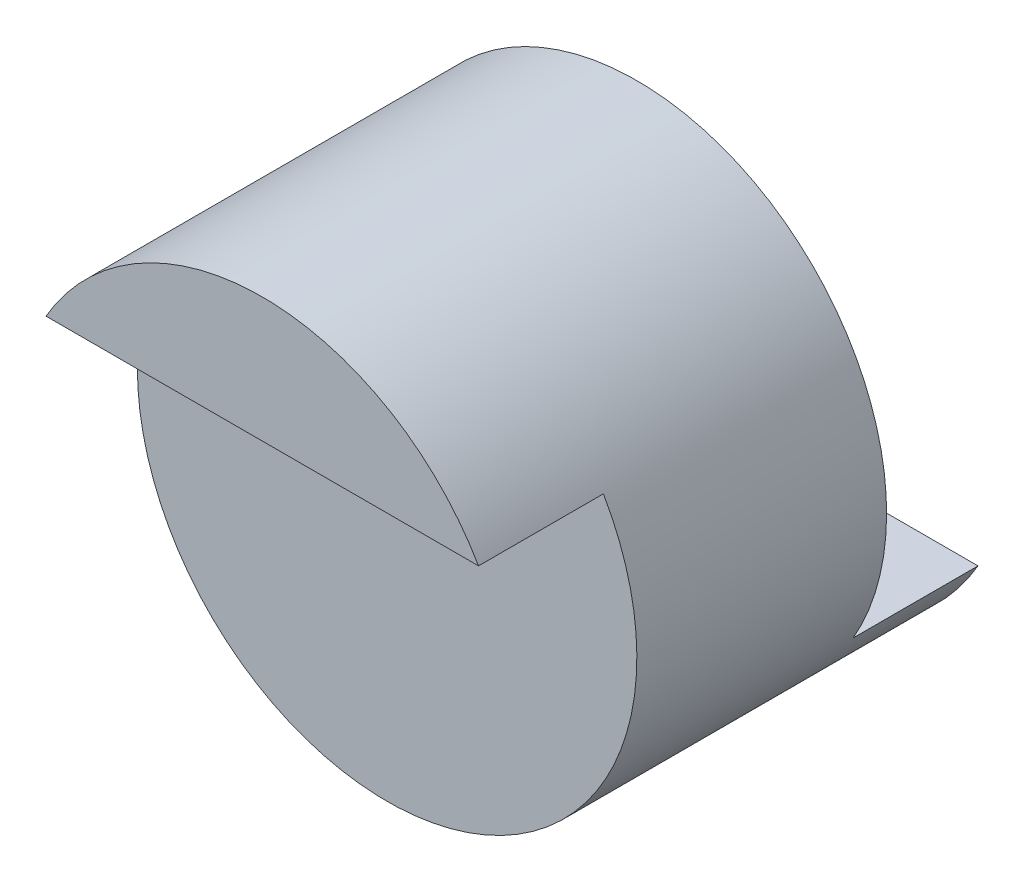
ISO-10303-21;
HEADER;
FILE_DESCRIPTION(('STEP AP214'),'2;1');
FILE_NAME('part.step','',(''),(''),'','','');
FILE_SCHEMA(('AUTOMOTIVE_DESIGN { 1 0 10303 214 1 1 1 1 }'));
ENDSEC;
DATA;
#1=APPLICATION_CONTEXT('core data for automotive mechanical design processes');
#2=APPLICATION_PROTOCOL_DEFINITION('international standard','automotive_design',2000,#1);
#3=PRODUCT_CONTEXT('',#1,'mechanical');
#4=PRODUCT('Part','Part','',(#3));
#5=PRODUCT_RELATED_PRODUCT_CATEGORY('part','',(#4));
#6=PRODUCT_DEFINITION_FORMATION('','',#4);
#7=PRODUCT_DEFINITION_CONTEXT('part definition',#1,'design');
#8=PRODUCT_DEFINITION('design','',#6,#7);
#9=PRODUCT_DEFINITION_SHAPE('','',#8);
#10=(LENGTH_UNIT() NAMED_UNIT(*) SI_UNIT(.MILLI.,.METRE.));
#11=(NAMED_UNIT(*) PLANE_ANGLE_UNIT() SI_UNIT($,.RADIAN.));
#12=(NAMED_UNIT(*) SI_UNIT($,.STERADIAN.) SOLID_ANGLE_UNIT());
#13=UNCERTAINTY_MEASURE_WITH_UNIT(LENGTH_MEASURE(1.E-05),#10,'distance_accuracy_value','');
#14=(GEOMETRIC_REPRESENTATION_CONTEXT(3) GLOBAL_UNCERTAINTY_ASSIGNED_CONTEXT((#13)) GLOBAL_UNIT_ASSIGNED_CONTEXT((#10,
#11,#12)) REPRESENTATION_CONTEXT('',''));
#15=CARTESIAN_POINT('',(0.,0.,0.));
#16=DIRECTION('',(0.,0.,1.));
#17=DIRECTION('',(1.,0.,0.));
#18=AXIS2_PLACEMENT_3D('',#15,#16,#17);
#19=CARTESIAN_POINT('',(0.,0.,0.));
#20=DIRECTION('',(0.,0.,1.));
#21=DIRECTION('',(1.,0.,0.));
#22=AXIS2_PLACEMENT_3D('',#19,#20,#21);
#23=PLANE('',#22);
#24=DIRECTION('',(1.,0.,0.));
#25=VECTOR('',#24,1.);
#26=CARTESIAN_POINT('',(-1.73205080756888,-1.,0.));
#27=LINE('',#26,#25);
#28=CARTESIAN_POINT('',(-1.73205080756888,-1.,0.));
#29=VERTEX_POINT('',#28);
#30=CARTESIAN_POINT('',(1.73205080756888,-1.,0.));
#31=VERTEX_POINT('',#30);
#32=EDGE_CURVE('E47',#29,#31,#27,.T.);
#33=ORIENTED_EDGE('',*,*,#32,.F.);
#34=CARTESIAN_POINT('',(0.,0.,0.));
#35=DIRECTION('',(0.,0.,1.));
#36=DIRECTION('',(1.,0.,0.));
#37=AXIS2_PLACEMENT_3D('',#34,#35,#36);
#38=CIRCLE('',#37,2.);
#39=EDGE_CURVE('E37',#31,#29,#38,.T.);
#40=ORIENTED_EDGE('',*,*,#39,.F.);
#41=EDGE_LOOP('',(#33,#40));
#42=FACE_BOUND('',#41,.T.);
#43=ADVANCED_FACE('F33',(#42),#23,.F.);
#44=CARTESIAN_POINT('',(0.,0.,2.));
#45=DIRECTION('',(0.,0.,-1.));
#46=DIRECTION('',(-1.,0.,0.));
#47=AXIS2_PLACEMENT_3D('',#44,#45,#46);
#48=CYLINDRICAL_SURFACE('',#47,2.);
#49=CARTESIAN_POINT('',(0.,0.,2.));
#50=DIRECTION('',(0.,0.,1.));
#51=DIRECTION('',(1.,0.,0.));
#52=AXIS2_PLACEMENT_3D('',#49,#50,#51);
#53=CIRCLE('',#52,2.);
#54=CARTESIAN_POINT('',(-1.73205080756888,1.,2.));
#55=VERTEX_POINT('',#54);
#56=CARTESIAN_POINT('',(1.73205080756888,1.,2.));
#57=VERTEX_POINT('',#56);
#58=EDGE_CURVE('E11',#55,#57,#53,.T.);
#59=ORIENTED_EDGE('',*,*,#58,.F.);
#60=DIRECTION('',(0.,0.,-1.));
#61=VECTOR('',#60,1.);
#62=CARTESIAN_POINT('',(-1.73205080756888,1.,3.));
#63=LINE('',#62,#61);
#64=CARTESIAN_POINT('',(-1.73205080756888,1.,3.));
#65=VERTEX_POINT('',#64);
#66=EDGE_CURVE('E100',#65,#55,#63,.T.);
#67=ORIENTED_EDGE('',*,*,#66,.F.);
#68=CARTESIAN_POINT('',(0.,0.,3.));
#69=DIRECTION('',(0.,0.,1.));
#70=DIRECTION('',(-1.,0.,0.));
#71=AXIS2_PLACEMENT_3D('',#68,#69,#70);
#72=CIRCLE('',#71,2.);
#73=CARTESIAN_POINT('',(1.73205080756888,1.,3.));
#74=VERTEX_POINT('',#73);
#75=EDGE_CURVE('E88',#74,#65,#72,.T.);
#76=ORIENTED_EDGE('',*,*,#75,.F.);
#77=DIRECTION('',(0.,0.,-1.));
#78=VECTOR('',#77,1.);
#79=CARTESIAN_POINT('',(1.73205080756888,1.,3.));
#80=LINE('',#79,#78);
#81=EDGE_CURVE('E96',#74,#57,#80,.T.);
#82=ORIENTED_EDGE('',*,*,#81,.T.);
#83=EDGE_LOOP('',(#59,#67,#76,#82));
#84=FACE_BOUND('',#83,.T.);
#85=ORIENTED_EDGE('',*,*,#39,.T.);
#86=DIRECTION('',(0.,0.,1.));
#87=VECTOR('',#86,1.);
#88=CARTESIAN_POINT('',(-1.73205080756888,-1.,-1.));
#89=LINE('',#88,#87);
#90=CARTESIAN_POINT('',(-1.73205080756888,-1.,-1.));
#91=VERTEX_POINT('',#90);
#92=EDGE_CURVE('E77',#91,#29,#89,.T.);
#93=ORIENTED_EDGE('',*,*,#92,.F.);
#94=CARTESIAN_POINT('',(0.,0.,-1.));
#95=DIRECTION('',(0.,0.,-1.));
#96=DIRECTION('',(1.,0.,0.));
#97=AXIS2_PLACEMENT_3D('',#94,#95,#96);
#98=CIRCLE('',#97,2.);
#99=CARTESIAN_POINT('',(1.73205080756888,-1.,-1.));
#100=VERTEX_POINT('',#99);
#101=EDGE_CURVE('E82',#100,#91,#98,.T.);
#102=ORIENTED_EDGE('',*,*,#101,.F.);
#103=DIRECTION('',(0.,0.,1.));
#104=VECTOR('',#103,1.);
#105=CARTESIAN_POINT('',(1.73205080756888,-1.,-1.));
#106=LINE('',#105,#104);
#107=EDGE_CURVE('E79',#100,#31,#106,.T.);
#108=ORIENTED_EDGE('',*,*,#107,.T.);
#109=EDGE_LOOP('',(#85,#93,#102,#108));
#110=FACE_BOUND('',#109,.T.);
#111=ADVANCED_FACE('F35',(#84,#110),#48,.T.);
#112=CARTESIAN_POINT('',(0.,0.,2.));
#113=DIRECTION('',(0.,0.,1.));
#114=DIRECTION('',(1.,0.,0.));
#115=AXIS2_PLACEMENT_3D('',#112,#113,#114);
#116=PLANE('',#115);
#117=DIRECTION('',(1.,0.,0.));
#118=VECTOR('',#117,1.);
#119=CARTESIAN_POINT('',(-1.73205080756888,1.,2.));
#120=LINE('',#119,#118);
#121=EDGE_CURVE('E53',#55,#57,#120,.T.);
#122=ORIENTED_EDGE('',*,*,#121,.F.);
#123=ORIENTED_EDGE('',*,*,#58,.T.);
#124=EDGE_LOOP('',(#122,#123));
#125=FACE_BOUND('',#124,.T.);
#126=ADVANCED_FACE('F108',(#125),#116,.T.);
#127=CARTESIAN_POINT('',(-1.73205080756888,1.,3.));
#128=DIRECTION('',(0.,1.,0.));
#129=DIRECTION('',(0.,0.,1.));
#130=AXIS2_PLACEMENT_3D('',#127,#128,#129);
#131=PLANE('',#130);
#132=ORIENTED_EDGE('',*,*,#121,.T.);
#133=ORIENTED_EDGE('',*,*,#81,.F.);
#134=DIRECTION('',(1.,0.,0.));
#135=VECTOR('',#134,1.);
#136=CARTESIAN_POINT('',(-1.73205080756888,1.,3.));
#137=LINE('',#136,#135);
#138=EDGE_CURVE('E95',#65,#74,#137,.T.);
#139=ORIENTED_EDGE('',*,*,#138,.F.);
#140=ORIENTED_EDGE('',*,*,#66,.T.);
#141=EDGE_LOOP('',(#132,#133,#139,#140));
#142=FACE_BOUND('',#141,.T.);
#143=ADVANCED_FACE('F104',(#142),#131,.F.);
#144=CARTESIAN_POINT('',(0.,0.,3.));
#145=DIRECTION('',(0.,0.,-1.));
#146=DIRECTION('',(-1.,0.,0.));
#147=AXIS2_PLACEMENT_3D('',#144,#145,#146);
#148=PLANE('',#147);
#149=ORIENTED_EDGE('',*,*,#75,.T.);
#150=ORIENTED_EDGE('',*,*,#138,.T.);
#151=EDGE_LOOP('',(#149,#150));
#152=FACE_BOUND('',#151,.T.);
#153=ADVANCED_FACE('F115',(#152),#148,.F.);
#154=CARTESIAN_POINT('',(-1.73205080756888,-1.,-1.));
#155=DIRECTION('',(0.,-1.,0.));
#156=DIRECTION('',(0.,0.,-1.));
#157=AXIS2_PLACEMENT_3D('',#154,#155,#156);
#158=PLANE('',#157);
#159=ORIENTED_EDGE('',*,*,#32,.T.);
#160=ORIENTED_EDGE('',*,*,#107,.F.);
#161=DIRECTION('',(1.,0.,0.));
#162=VECTOR('',#161,1.);
#163=CARTESIAN_POINT('',(-1.73205080756888,-1.,-1.));
#164=LINE('',#163,#162);
#165=EDGE_CURVE('E73',#91,#100,#164,.T.);
#166=ORIENTED_EDGE('',*,*,#165,.F.);
#167=ORIENTED_EDGE('',*,*,#92,.T.);
#168=EDGE_LOOP('',(#159,#160,#166,#167));
#169=FACE_BOUND('',#168,.T.);
#170=ADVANCED_FACE('F75',(#169),#158,.F.);
#171=CARTESIAN_POINT('',(0.,0.,-1.));
#172=DIRECTION('',(0.,0.,1.));
#173=DIRECTION('',(1.,0.,0.));
#174=AXIS2_PLACEMENT_3D('',#171,#172,#173);
#175=PLANE('',#174);
#176=ORIENTED_EDGE('',*,*,#101,.T.);
#177=ORIENTED_EDGE('',*,*,#165,.T.);
#178=EDGE_LOOP('',(#176,#177));
#179=FACE_BOUND('',#178,.T.);
#180=ADVANCED_FACE('F84',(#179),#175,.F.);
#181=CLOSED_SHELL('',(#43,#111,#126,#143,#153,#170,#180));
#182=MANIFOLD_SOLID_BREP('B2',#181);
#183=ADVANCED_BREP_SHAPE_REPRESENTATION('',(#18,#182),#14);
#184=SHAPE_DEFINITION_REPRESENTATION(#9,#183);
ENDSEC;
END-ISO-10303-21;
